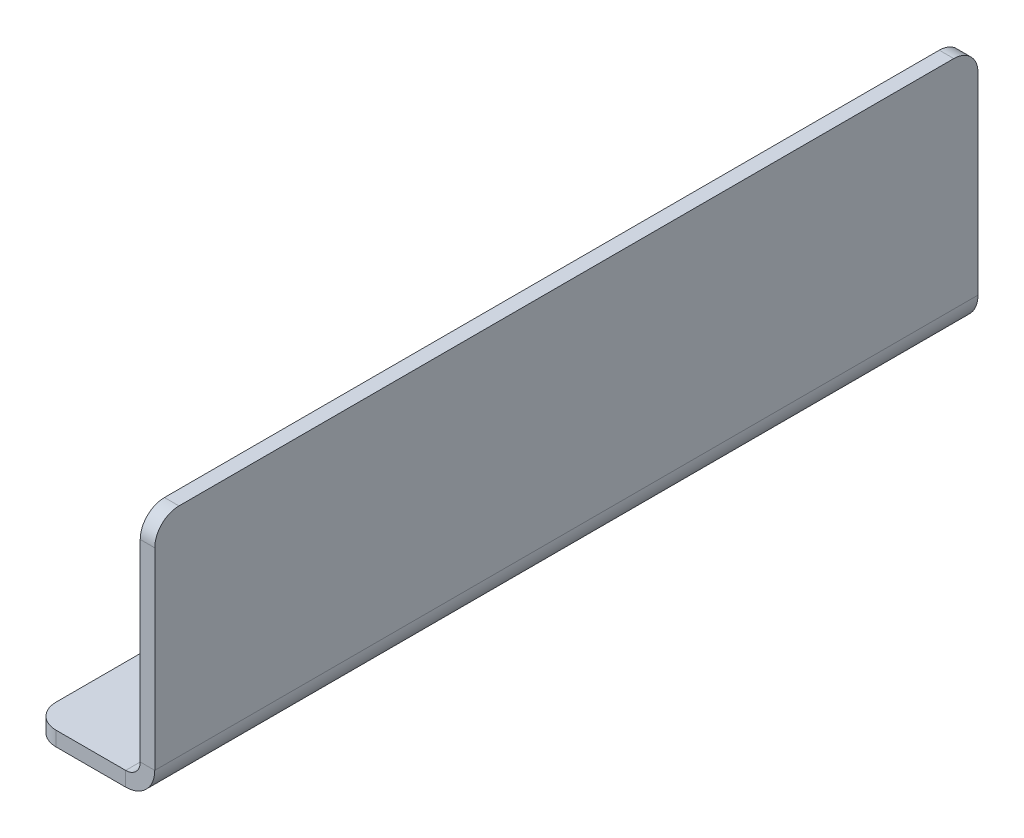
ISO-10303-21;
HEADER;
FILE_DESCRIPTION(('STEP AP214'),'2;1');
FILE_NAME('part.step','',(''),(''),'','','');
FILE_SCHEMA(('AUTOMOTIVE_DESIGN { 1 0 10303 214 1 1 1 1 }'));
ENDSEC;
DATA;
#1=APPLICATION_CONTEXT('core data for automotive mechanical design processes');
#2=APPLICATION_PROTOCOL_DEFINITION('international standard','automotive_design',2000,#1);
#3=PRODUCT_CONTEXT('',#1,'mechanical');
#4=PRODUCT('Part','Part','',(#3));
#5=PRODUCT_RELATED_PRODUCT_CATEGORY('part','',(#4));
#6=PRODUCT_DEFINITION_FORMATION('','',#4);
#7=PRODUCT_DEFINITION_CONTEXT('part definition',#1,'design');
#8=PRODUCT_DEFINITION('design','',#6,#7);
#9=PRODUCT_DEFINITION_SHAPE('','',#8);
#10=(LENGTH_UNIT() NAMED_UNIT(*) SI_UNIT(.MILLI.,.METRE.));
#11=(NAMED_UNIT(*) PLANE_ANGLE_UNIT() SI_UNIT($,.RADIAN.));
#12=(NAMED_UNIT(*) SI_UNIT($,.STERADIAN.) SOLID_ANGLE_UNIT());
#13=UNCERTAINTY_MEASURE_WITH_UNIT(LENGTH_MEASURE(1.E-05),#10,'distance_accuracy_value','');
#14=(GEOMETRIC_REPRESENTATION_CONTEXT(3) GLOBAL_UNCERTAINTY_ASSIGNED_CONTEXT((#13)) GLOBAL_UNIT_ASSIGNED_CONTEXT((#10,
#11,#12)) REPRESENTATION_CONTEXT('',''));
#15=CARTESIAN_POINT('',(0.,0.,0.));
#16=DIRECTION('',(0.,0.,1.));
#17=DIRECTION('',(1.,0.,0.));
#18=AXIS2_PLACEMENT_3D('',#15,#16,#17);
#19=CARTESIAN_POINT('',(0.,0.,170.));
#20=DIRECTION('',(0.,-1.,0.));
#21=DIRECTION('',(1.,0.,0.));
#22=AXIS2_PLACEMENT_3D('',#19,#20,#21);
#23=PLANE('',#22);
#24=CARTESIAN_POINT('',(-15.7,0.,25.));
#25=DIRECTION('',(0.,1.,0.));
#26=DIRECTION('',(0.,0.,1.));
#27=AXIS2_PLACEMENT_3D('',#24,#25,#26);
#28=CIRCLE('',#27,1.63195);
#29=CARTESIAN_POINT('',(-15.7,0.,26.63195));
#30=VERTEX_POINT('',#29);
#31=EDGE_CURVE('E288',#30,#30,#28,.T.);
#32=ORIENTED_EDGE('',*,*,#31,.T.);
#33=EDGE_LOOP('',(#32));
#34=FACE_BOUND('',#33,.T.);
#35=CARTESIAN_POINT('',(-15.7,0.,75.));
#36=DIRECTION('',(0.,1.,0.));
#37=DIRECTION('',(0.,0.,1.));
#38=AXIS2_PLACEMENT_3D('',#35,#36,#37);
#39=CIRCLE('',#38,1.63195);
#40=CARTESIAN_POINT('',(-15.7,0.,76.63195));
#41=VERTEX_POINT('',#40);
#42=EDGE_CURVE('E282',#41,#41,#39,.T.);
#43=ORIENTED_EDGE('',*,*,#42,.T.);
#44=EDGE_LOOP('',(#43));
#45=FACE_BOUND('',#44,.T.);
#46=DIRECTION('',(0.,0.,-1.));
#47=VECTOR('',#46,1.);
#48=CARTESIAN_POINT('',(-25.4,0.,170.));
#49=LINE('',#48,#47);
#50=CARTESIAN_POINT('',(-25.4,0.,165.));
#51=VERTEX_POINT('',#50);
#52=CARTESIAN_POINT('',(-25.4,0.,5.));
#53=VERTEX_POINT('',#52);
#54=EDGE_CURVE('E164',#51,#53,#49,.T.);
#55=ORIENTED_EDGE('',*,*,#54,.T.);
#56=CARTESIAN_POINT('',(-20.4,0.,5.));
#57=DIRECTION('',(0.,-1.,0.));
#58=DIRECTION('',(1.,0.,0.));
#59=AXIS2_PLACEMENT_3D('',#56,#57,#58);
#60=CIRCLE('',#59,5.);
#61=CARTESIAN_POINT('',(-20.4,0.,0.));
#62=VERTEX_POINT('',#61);
#63=EDGE_CURVE('E231',#53,#62,#60,.T.);
#64=ORIENTED_EDGE('',*,*,#63,.T.);
#65=DIRECTION('',(-1.,0.,0.));
#66=VECTOR('',#65,1.);
#67=CARTESIAN_POINT('',(0.,0.,0.));
#68=LINE('',#67,#66);
#69=CARTESIAN_POINT('',(-6.,0.,0.));
#70=VERTEX_POINT('',#69);
#71=EDGE_CURVE('E160',#70,#62,#68,.T.);
#72=ORIENTED_EDGE('',*,*,#71,.F.);
#73=DIRECTION('',(0.,0.,-1.));
#74=VECTOR('',#73,1.);
#75=CARTESIAN_POINT('',(-6.,0.,170.));
#76=LINE('',#75,#74);
#77=CARTESIAN_POINT('',(-6.,0.,170.));
#78=VERTEX_POINT('',#77);
#79=EDGE_CURVE('E154',#78,#70,#76,.T.);
#80=ORIENTED_EDGE('',*,*,#79,.F.);
#81=DIRECTION('',(-1.,0.,0.));
#82=VECTOR('',#81,1.);
#83=CARTESIAN_POINT('',(0.,0.,170.));
#84=LINE('',#83,#82);
#85=CARTESIAN_POINT('',(-20.4,0.,170.));
#86=VERTEX_POINT('',#85);
#87=EDGE_CURVE('E157',#78,#86,#84,.T.);
#88=ORIENTED_EDGE('',*,*,#87,.T.);
#89=CARTESIAN_POINT('',(-20.4,0.,165.));
#90=DIRECTION('',(0.,-1.,0.));
#91=DIRECTION('',(1.,0.,0.));
#92=AXIS2_PLACEMENT_3D('',#89,#90,#91);
#93=CIRCLE('',#92,5.);
#94=EDGE_CURVE('E229',#86,#51,#93,.T.);
#95=ORIENTED_EDGE('',*,*,#94,.T.);
#96=EDGE_LOOP('',(#55,#64,#72,#80,#88,#95));
#97=FACE_BOUND('',#96,.T.);
#98=CARTESIAN_POINT('',(-15.7,0.,125.));
#99=DIRECTION('',(0.,1.,0.));
#100=DIRECTION('',(0.,0.,1.));
#101=AXIS2_PLACEMENT_3D('',#98,#99,#100);
#102=CIRCLE('',#101,1.63195);
#103=CARTESIAN_POINT('',(-15.7,0.,126.63195));
#104=VERTEX_POINT('',#103);
#105=EDGE_CURVE('E186',#104,#104,#102,.T.);
#106=ORIENTED_EDGE('',*,*,#105,.T.);
#107=EDGE_LOOP('',(#106));
#108=FACE_BOUND('',#107,.T.);
#109=ADVANCED_FACE('F45',(#34,#45,#97,#108),#23,.T.);
#110=CARTESIAN_POINT('',(-6.,0.,170.));
#111=DIRECTION('',(0.,0.,1.));
#112=DIRECTION('',(1.,0.,0.));
#113=AXIS2_PLACEMENT_3D('',#110,#111,#112);
#114=PLANE('',#113);
#115=DIRECTION('',(0.,1.,0.));
#116=VECTOR('',#115,1.);
#117=CARTESIAN_POINT('',(-6.,0.,170.));
#118=LINE('',#117,#116);
#119=CARTESIAN_POINT('',(-6.,3.,170.));
#120=VERTEX_POINT('',#119);
#121=EDGE_CURVE('E135',#78,#120,#118,.T.);
#122=ORIENTED_EDGE('',*,*,#121,.F.);
#123=CARTESIAN_POINT('',(-6.,6.,170.));
#124=DIRECTION('',(0.,0.,1.));
#125=DIRECTION('',(1.,0.,0.));
#126=AXIS2_PLACEMENT_3D('',#123,#124,#125);
#127=CIRCLE('',#126,6.);
#128=CARTESIAN_POINT('',(0.,6.,170.));
#129=VERTEX_POINT('',#128);
#130=EDGE_CURVE('E140',#129,#78,#127,.F.);
#131=ORIENTED_EDGE('',*,*,#130,.F.);
#132=DIRECTION('',(1.,0.,0.));
#133=VECTOR('',#132,1.);
#134=CARTESIAN_POINT('',(-3.,6.,170.));
#135=LINE('',#134,#133);
#136=CARTESIAN_POINT('',(-3.,6.,170.));
#137=VERTEX_POINT('',#136);
#138=EDGE_CURVE('E148',#137,#129,#135,.T.);
#139=ORIENTED_EDGE('',*,*,#138,.F.);
#140=CARTESIAN_POINT('',(-6.,6.,170.));
#141=DIRECTION('',(0.,0.,1.));
#142=DIRECTION('',(1.,0.,0.));
#143=AXIS2_PLACEMENT_3D('',#140,#141,#142);
#144=CIRCLE('',#143,3.);
#145=EDGE_CURVE('E142',#137,#120,#144,.F.);
#146=ORIENTED_EDGE('',*,*,#145,.T.);
#147=EDGE_LOOP('',(#122,#131,#139,#146));
#148=FACE_BOUND('',#147,.T.);
#149=ADVANCED_FACE('F137',(#148),#114,.T.);
#150=CARTESIAN_POINT('',(-3.,6.,170.));
#151=DIRECTION('',(0.,0.,1.));
#152=DIRECTION('',(1.,0.,0.));
#153=AXIS2_PLACEMENT_3D('',#150,#151,#152);
#154=PLANE('',#153);
#155=DIRECTION('',(-1.,0.,0.));
#156=VECTOR('',#155,1.);
#157=CARTESIAN_POINT('',(0.,3.,170.));
#158=LINE('',#157,#156);
#159=CARTESIAN_POINT('',(-20.4,3.,170.));
#160=VERTEX_POINT('',#159);
#161=EDGE_CURVE('E169',#120,#160,#158,.T.);
#162=ORIENTED_EDGE('',*,*,#161,.T.);
#163=DIRECTION('',(0.,1.,0.));
#164=VECTOR('',#163,1.);
#165=CARTESIAN_POINT('',(-20.4,6.,170.));
#166=LINE('',#165,#164);
#167=EDGE_CURVE('E11',#160,#86,#166,.F.);
#168=ORIENTED_EDGE('',*,*,#167,.T.);
#169=ORIENTED_EDGE('',*,*,#87,.F.);
#170=ORIENTED_EDGE('',*,*,#121,.T.);
#171=EDGE_LOOP('',(#162,#168,#169,#170));
#172=FACE_BOUND('',#171,.T.);
#173=ADVANCED_FACE('F167',(#172),#154,.T.);
#174=CARTESIAN_POINT('',(0.,6.,0.));
#175=DIRECTION('',(0.,0.,-1.));
#176=DIRECTION('',(-1.,0.,0.));
#177=AXIS2_PLACEMENT_3D('',#174,#175,#176);
#178=PLANE('',#177);
#179=DIRECTION('',(-1.,0.,0.));
#180=VECTOR('',#179,1.);
#181=CARTESIAN_POINT('',(0.,6.,0.));
#182=LINE('',#181,#180);
#183=CARTESIAN_POINT('',(0.,6.,0.));
#184=VERTEX_POINT('',#183);
#185=CARTESIAN_POINT('',(-3.,6.,0.));
#186=VERTEX_POINT('',#185);
#187=EDGE_CURVE('E213',#184,#186,#182,.T.);
#188=ORIENTED_EDGE('',*,*,#187,.F.);
#189=CARTESIAN_POINT('',(-6.,6.,0.));
#190=DIRECTION('',(0.,0.,1.));
#191=DIRECTION('',(1.,0.,0.));
#192=AXIS2_PLACEMENT_3D('',#189,#190,#191);
#193=CIRCLE('',#192,6.);
#194=EDGE_CURVE('E188',#184,#70,#193,.F.);
#195=ORIENTED_EDGE('',*,*,#194,.T.);
#196=DIRECTION('',(0.,-1.,0.));
#197=VECTOR('',#196,1.);
#198=CARTESIAN_POINT('',(-6.,3.,0.));
#199=LINE('',#198,#197);
#200=CARTESIAN_POINT('',(-6.,3.,0.));
#201=VERTEX_POINT('',#200);
#202=EDGE_CURVE('E211',#201,#70,#199,.T.);
#203=ORIENTED_EDGE('',*,*,#202,.F.);
#204=CARTESIAN_POINT('',(-6.,6.,0.));
#205=DIRECTION('',(0.,0.,1.));
#206=DIRECTION('',(1.,0.,0.));
#207=AXIS2_PLACEMENT_3D('',#204,#205,#206);
#208=CIRCLE('',#207,3.);
#209=EDGE_CURVE('E194',#186,#201,#208,.F.);
#210=ORIENTED_EDGE('',*,*,#209,.F.);
#211=EDGE_LOOP('',(#188,#195,#203,#210));
#212=FACE_BOUND('',#211,.T.);
#213=ADVANCED_FACE('F340',(#212),#178,.T.);
#214=CARTESIAN_POINT('',(-6.,3.,0.));
#215=DIRECTION('',(0.,0.,-1.));
#216=DIRECTION('',(-1.,0.,0.));
#217=AXIS2_PLACEMENT_3D('',#214,#215,#216);
#218=PLANE('',#217);
#219=DIRECTION('',(0.,1.,0.));
#220=VECTOR('',#219,1.);
#221=CARTESIAN_POINT('',(-3.,0.,0.));
#222=LINE('',#221,#220);
#223=CARTESIAN_POINT('',(-3.,45.8,0.));
#224=VERTEX_POINT('',#223);
#225=EDGE_CURVE('E192',#224,#186,#222,.F.);
#226=ORIENTED_EDGE('',*,*,#225,.F.);
#227=DIRECTION('',(1.,0.,0.));
#228=VECTOR('',#227,1.);
#229=CARTESIAN_POINT('',(-6.,45.8,0.));
#230=LINE('',#229,#228);
#231=CARTESIAN_POINT('',(0.,45.8,0.));
#232=VERTEX_POINT('',#231);
#233=EDGE_CURVE('E233',#224,#232,#230,.T.);
#234=ORIENTED_EDGE('',*,*,#233,.T.);
#235=DIRECTION('',(0.,-1.,0.));
#236=VECTOR('',#235,1.);
#237=CARTESIAN_POINT('',(0.,0.,0.));
#238=LINE('',#237,#236);
#239=EDGE_CURVE('E190',#232,#184,#238,.T.);
#240=ORIENTED_EDGE('',*,*,#239,.T.);
#241=ORIENTED_EDGE('',*,*,#187,.T.);
#242=EDGE_LOOP('',(#226,#234,#240,#241));
#243=FACE_BOUND('',#242,.T.);
#244=ADVANCED_FACE('F255',(#243),#218,.T.);
#245=CARTESIAN_POINT('',(0.,3.,170.));
#246=DIRECTION('',(0.,-1.,0.));
#247=DIRECTION('',(1.,0.,0.));
#248=AXIS2_PLACEMENT_3D('',#245,#246,#247);
#249=PLANE('',#248);
#250=CARTESIAN_POINT('',(-15.7,3.,25.));
#251=DIRECTION('',(0.,1.,0.));
#252=DIRECTION('',(0.,0.,1.));
#253=AXIS2_PLACEMENT_3D('',#250,#251,#252);
#254=CIRCLE('',#253,1.63194999999999);
#255=CARTESIAN_POINT('',(-15.7,3.,26.63195));
#256=VERTEX_POINT('',#255);
#257=EDGE_CURVE('E291',#256,#256,#254,.T.);
#258=ORIENTED_EDGE('',*,*,#257,.F.);
#259=EDGE_LOOP('',(#258));
#260=FACE_BOUND('',#259,.T.);
#261=CARTESIAN_POINT('',(-15.7,3.,75.));
#262=DIRECTION('',(0.,1.,0.));
#263=DIRECTION('',(0.,0.,1.));
#264=AXIS2_PLACEMENT_3D('',#261,#262,#263);
#265=CIRCLE('',#264,1.63194999999999);
#266=CARTESIAN_POINT('',(-15.7,3.,76.63195));
#267=VERTEX_POINT('',#266);
#268=EDGE_CURVE('E285',#267,#267,#265,.T.);
#269=ORIENTED_EDGE('',*,*,#268,.F.);
#270=EDGE_LOOP('',(#269));
#271=FACE_BOUND('',#270,.T.);
#272=CARTESIAN_POINT('',(-15.7,3.,125.));
#273=DIRECTION('',(0.,1.,0.));
#274=DIRECTION('',(0.,0.,1.));
#275=AXIS2_PLACEMENT_3D('',#272,#273,#274);
#276=CIRCLE('',#275,1.63194999999999);
#277=CARTESIAN_POINT('',(-15.7,3.,126.63195));
#278=VERTEX_POINT('',#277);
#279=EDGE_CURVE('E279',#278,#278,#276,.T.);
#280=ORIENTED_EDGE('',*,*,#279,.F.);
#281=EDGE_LOOP('',(#280));
#282=FACE_BOUND('',#281,.T.);
#283=DIRECTION('',(-1.,0.,0.));
#284=VECTOR('',#283,1.);
#285=CARTESIAN_POINT('',(0.,3.,0.));
#286=LINE('',#285,#284);
#287=CARTESIAN_POINT('',(-20.4,3.,0.));
#288=VERTEX_POINT('',#287);
#289=EDGE_CURVE('E183',#201,#288,#286,.T.);
#290=ORIENTED_EDGE('',*,*,#289,.T.);
#291=CARTESIAN_POINT('',(-20.4,3.,5.));
#292=DIRECTION('',(0.,-1.,0.));
#293=DIRECTION('',(1.,0.,0.));
#294=AXIS2_PLACEMENT_3D('',#291,#292,#293);
#295=CIRCLE('',#294,5.);
#296=CARTESIAN_POINT('',(-25.4,3.,5.));
#297=VERTEX_POINT('',#296);
#298=EDGE_CURVE('E222',#288,#297,#295,.F.);
#299=ORIENTED_EDGE('',*,*,#298,.T.);
#300=DIRECTION('',(0.,0.,-1.));
#301=VECTOR('',#300,1.);
#302=CARTESIAN_POINT('',(-25.4,3.,170.));
#303=LINE('',#302,#301);
#304=CARTESIAN_POINT('',(-25.4,3.,165.));
#305=VERTEX_POINT('',#304);
#306=EDGE_CURVE('E208',#305,#297,#303,.T.);
#307=ORIENTED_EDGE('',*,*,#306,.F.);
#308=CARTESIAN_POINT('',(-20.4,3.,165.));
#309=DIRECTION('',(0.,-1.,0.));
#310=DIRECTION('',(1.,0.,0.));
#311=AXIS2_PLACEMENT_3D('',#308,#309,#310);
#312=CIRCLE('',#311,5.);
#313=EDGE_CURVE('E220',#305,#160,#312,.F.);
#314=ORIENTED_EDGE('',*,*,#313,.T.);
#315=ORIENTED_EDGE('',*,*,#161,.F.);
#316=DIRECTION('',(0.,0.,-1.));
#317=VECTOR('',#316,1.);
#318=CARTESIAN_POINT('',(-6.,3.,170.));
#319=LINE('',#318,#317);
#320=EDGE_CURVE('E182',#120,#201,#319,.T.);
#321=ORIENTED_EDGE('',*,*,#320,.T.);
#322=EDGE_LOOP('',(#290,#299,#307,#314,#315,#321));
#323=FACE_BOUND('',#322,.T.);
#324=ADVANCED_FACE('F274',(#260,#271,#282,#323),#249,.F.);
#325=CARTESIAN_POINT('',(-25.4,0.,170.));
#326=DIRECTION('',(-1.,0.,0.));
#327=DIRECTION('',(0.,0.,1.));
#328=AXIS2_PLACEMENT_3D('',#325,#326,#327);
#329=PLANE('',#328);
#330=ORIENTED_EDGE('',*,*,#306,.T.);
#331=DIRECTION('',(0.,1.,0.));
#332=VECTOR('',#331,1.);
#333=CARTESIAN_POINT('',(-25.4,0.,5.));
#334=LINE('',#333,#332);
#335=EDGE_CURVE('E227',#297,#53,#334,.F.);
#336=ORIENTED_EDGE('',*,*,#335,.T.);
#337=ORIENTED_EDGE('',*,*,#54,.F.);
#338=DIRECTION('',(0.,1.,0.));
#339=VECTOR('',#338,1.);
#340=CARTESIAN_POINT('',(-25.4,0.,165.));
#341=LINE('',#340,#339);
#342=EDGE_CURVE('E224',#51,#305,#341,.T.);
#343=ORIENTED_EDGE('',*,*,#342,.T.);
#344=EDGE_LOOP('',(#330,#336,#337,#343));
#345=FACE_BOUND('',#344,.T.);
#346=ADVANCED_FACE('F299',(#345),#329,.T.);
#347=CARTESIAN_POINT('',(-6.,6.,170.));
#348=DIRECTION('',(0.,0.,-1.));
#349=DIRECTION('',(-1.,0.,0.));
#350=AXIS2_PLACEMENT_3D('',#347,#348,#349);
#351=CYLINDRICAL_SURFACE('',#350,6.);
#352=ORIENTED_EDGE('',*,*,#194,.F.);
#353=DIRECTION('',(0.,0.,-1.));
#354=VECTOR('',#353,1.);
#355=CARTESIAN_POINT('',(0.,6.,170.));
#356=LINE('',#355,#354);
#357=EDGE_CURVE('E165',#129,#184,#356,.T.);
#358=ORIENTED_EDGE('',*,*,#357,.F.);
#359=ORIENTED_EDGE('',*,*,#130,.T.);
#360=ORIENTED_EDGE('',*,*,#79,.T.);
#361=EDGE_LOOP('',(#352,#358,#359,#360));
#362=FACE_BOUND('',#361,.T.);
#363=ADVANCED_FACE('F172',(#362),#351,.T.);
#364=CARTESIAN_POINT('',(0.,0.,170.));
#365=DIRECTION('',(1.,0.,0.));
#366=DIRECTION('',(0.,0.,-1.));
#367=AXIS2_PLACEMENT_3D('',#364,#365,#366);
#368=PLANE('',#367);
#369=ORIENTED_EDGE('',*,*,#239,.F.);
#370=CARTESIAN_POINT('',(0.,45.8,5.));
#371=DIRECTION('',(1.,0.,0.));
#372=DIRECTION('',(0.,0.,-1.));
#373=AXIS2_PLACEMENT_3D('',#370,#371,#372);
#374=CIRCLE('',#373,5.);
#375=CARTESIAN_POINT('',(0.,50.8,5.));
#376=VERTEX_POINT('',#375);
#377=EDGE_CURVE('E238',#232,#376,#374,.T.);
#378=ORIENTED_EDGE('',*,*,#377,.T.);
#379=DIRECTION('',(0.,0.,-1.));
#380=VECTOR('',#379,1.);
#381=CARTESIAN_POINT('',(0.,50.8,170.));
#382=LINE('',#381,#380);
#383=CARTESIAN_POINT('',(0.,50.8,165.));
#384=VERTEX_POINT('',#383);
#385=EDGE_CURVE('E204',#384,#376,#382,.T.);
#386=ORIENTED_EDGE('',*,*,#385,.F.);
#387=CARTESIAN_POINT('',(0.,45.8,165.));
#388=DIRECTION('',(1.,0.,0.));
#389=DIRECTION('',(0.,0.,-1.));
#390=AXIS2_PLACEMENT_3D('',#387,#388,#389);
#391=CIRCLE('',#390,5.);
#392=CARTESIAN_POINT('',(0.,45.8,170.));
#393=VERTEX_POINT('',#392);
#394=EDGE_CURVE('E236',#384,#393,#391,.T.);
#395=ORIENTED_EDGE('',*,*,#394,.T.);
#396=DIRECTION('',(0.,-1.,0.));
#397=VECTOR('',#396,1.);
#398=CARTESIAN_POINT('',(0.,0.,170.));
#399=LINE('',#398,#397);
#400=EDGE_CURVE('E174',#393,#129,#399,.T.);
#401=ORIENTED_EDGE('',*,*,#400,.T.);
#402=ORIENTED_EDGE('',*,*,#357,.T.);
#403=EDGE_LOOP('',(#369,#378,#386,#395,#401,#402));
#404=FACE_BOUND('',#403,.T.);
#405=ADVANCED_FACE('F261',(#404),#368,.T.);
#406=CARTESIAN_POINT('',(-3.,50.8,170.));
#407=DIRECTION('',(0.,1.,0.));
#408=DIRECTION('',(0.,0.,1.));
#409=AXIS2_PLACEMENT_3D('',#406,#407,#408);
#410=PLANE('',#409);
#411=ORIENTED_EDGE('',*,*,#385,.T.);
#412=DIRECTION('',(1.,0.,0.));
#413=VECTOR('',#412,1.);
#414=CARTESIAN_POINT('',(-3.,50.8,5.));
#415=LINE('',#414,#413);
#416=CARTESIAN_POINT('',(-3.,50.8,5.));
#417=VERTEX_POINT('',#416);
#418=EDGE_CURVE('E67',#376,#417,#415,.F.);
#419=ORIENTED_EDGE('',*,*,#418,.T.);
#420=DIRECTION('',(0.,0.,-1.));
#421=VECTOR('',#420,1.);
#422=CARTESIAN_POINT('',(-3.,50.8,170.));
#423=LINE('',#422,#421);
#424=CARTESIAN_POINT('',(-3.,50.8,165.));
#425=VERTEX_POINT('',#424);
#426=EDGE_CURVE('E202',#425,#417,#423,.T.);
#427=ORIENTED_EDGE('',*,*,#426,.F.);
#428=DIRECTION('',(1.,0.,0.));
#429=VECTOR('',#428,1.);
#430=CARTESIAN_POINT('',(-3.,50.8,165.));
#431=LINE('',#430,#429);
#432=EDGE_CURVE('E240',#425,#384,#431,.T.);
#433=ORIENTED_EDGE('',*,*,#432,.T.);
#434=EDGE_LOOP('',(#411,#419,#427,#433));
#435=FACE_BOUND('',#434,.T.);
#436=ADVANCED_FACE('F262',(#435),#410,.T.);
#437=CARTESIAN_POINT('',(-3.,0.,170.));
#438=DIRECTION('',(1.,0.,0.));
#439=DIRECTION('',(0.,0.,-1.));
#440=AXIS2_PLACEMENT_3D('',#437,#438,#439);
#441=PLANE('',#440);
#442=ORIENTED_EDGE('',*,*,#426,.T.);
#443=CARTESIAN_POINT('',(-3.,45.8,5.));
#444=DIRECTION('',(1.,0.,0.));
#445=DIRECTION('',(0.,0.,-1.));
#446=AXIS2_PLACEMENT_3D('',#443,#444,#445);
#447=CIRCLE('',#446,5.);
#448=EDGE_CURVE('E246',#417,#224,#447,.F.);
#449=ORIENTED_EDGE('',*,*,#448,.T.);
#450=ORIENTED_EDGE('',*,*,#225,.T.);
#451=DIRECTION('',(0.,0.,-1.));
#452=VECTOR('',#451,1.);
#453=CARTESIAN_POINT('',(-3.,6.,170.));
#454=LINE('',#453,#452);
#455=EDGE_CURVE('E199',#137,#186,#454,.T.);
#456=ORIENTED_EDGE('',*,*,#455,.F.);
#457=DIRECTION('',(0.,1.,0.));
#458=VECTOR('',#457,1.);
#459=CARTESIAN_POINT('',(-3.,0.,170.));
#460=LINE('',#459,#458);
#461=CARTESIAN_POINT('',(-3.,45.8,170.));
#462=VERTEX_POINT('',#461);
#463=EDGE_CURVE('E176',#462,#137,#460,.F.);
#464=ORIENTED_EDGE('',*,*,#463,.F.);
#465=CARTESIAN_POINT('',(-3.,45.8,165.));
#466=DIRECTION('',(1.,0.,0.));
#467=DIRECTION('',(0.,0.,-1.));
#468=AXIS2_PLACEMENT_3D('',#465,#466,#467);
#469=CIRCLE('',#468,5.);
#470=EDGE_CURVE('E244',#462,#425,#469,.F.);
#471=ORIENTED_EDGE('',*,*,#470,.T.);
#472=EDGE_LOOP('',(#442,#449,#450,#456,#464,#471));
#473=FACE_BOUND('',#472,.T.);
#474=ADVANCED_FACE('F250',(#473),#441,.F.);
#475=CARTESIAN_POINT('',(-6.,6.,170.));
#476=DIRECTION('',(0.,0.,-1.));
#477=DIRECTION('',(-1.,0.,0.));
#478=AXIS2_PLACEMENT_3D('',#475,#476,#477);
#479=CYLINDRICAL_SURFACE('',#478,3.);
#480=ORIENTED_EDGE('',*,*,#209,.T.);
#481=ORIENTED_EDGE('',*,*,#320,.F.);
#482=ORIENTED_EDGE('',*,*,#145,.F.);
#483=ORIENTED_EDGE('',*,*,#455,.T.);
#484=EDGE_LOOP('',(#480,#481,#482,#483));
#485=FACE_BOUND('',#484,.T.);
#486=ADVANCED_FACE('F270',(#485),#479,.F.);
#487=CARTESIAN_POINT('',(-6.,6.,170.));
#488=DIRECTION('',(0.,0.,1.));
#489=DIRECTION('',(1.,0.,0.));
#490=AXIS2_PLACEMENT_3D('',#487,#488,#489);
#491=PLANE('',#490);
#492=ORIENTED_EDGE('',*,*,#400,.F.);
#493=DIRECTION('',(1.,0.,0.));
#494=VECTOR('',#493,1.);
#495=CARTESIAN_POINT('',(-6.,45.8,170.));
#496=LINE('',#495,#494);
#497=EDGE_CURVE('E53',#393,#462,#496,.F.);
#498=ORIENTED_EDGE('',*,*,#497,.T.);
#499=ORIENTED_EDGE('',*,*,#463,.T.);
#500=ORIENTED_EDGE('',*,*,#138,.T.);
#501=EDGE_LOOP('',(#492,#498,#499,#500));
#502=FACE_BOUND('',#501,.T.);
#503=ADVANCED_FACE('F267',(#502),#491,.T.);
#504=CARTESIAN_POINT('',(-6.,6.,0.));
#505=DIRECTION('',(0.,0.,1.));
#506=DIRECTION('',(1.,0.,0.));
#507=AXIS2_PLACEMENT_3D('',#504,#505,#506);
#508=PLANE('',#507);
#509=ORIENTED_EDGE('',*,*,#71,.T.);
#510=DIRECTION('',(0.,1.,0.));
#511=VECTOR('',#510,1.);
#512=CARTESIAN_POINT('',(-20.4,3.,0.));
#513=LINE('',#512,#511);
#514=EDGE_CURVE('E147',#62,#288,#513,.T.);
#515=ORIENTED_EDGE('',*,*,#514,.T.);
#516=ORIENTED_EDGE('',*,*,#289,.F.);
#517=ORIENTED_EDGE('',*,*,#202,.T.);
#518=EDGE_LOOP('',(#509,#515,#516,#517));
#519=FACE_BOUND('',#518,.T.);
#520=ADVANCED_FACE('F308',(#519),#508,.F.);
#521=CARTESIAN_POINT('',(-15.7,3.,125.));
#522=DIRECTION('',(0.,1.,0.));
#523=DIRECTION('',(0.,0.,1.));
#524=AXIS2_PLACEMENT_3D('',#521,#522,#523);
#525=CYLINDRICAL_SURFACE('',#524,1.63194999999999);
#526=ORIENTED_EDGE('',*,*,#105,.F.);
#527=EDGE_LOOP('',(#526));
#528=FACE_BOUND('',#527,.T.);
#529=ORIENTED_EDGE('',*,*,#279,.T.);
#530=EDGE_LOOP('',(#529));
#531=FACE_BOUND('',#530,.T.);
#532=ADVANCED_FACE('F305',(#528,#531),#525,.F.);
#533=CARTESIAN_POINT('',(-15.7,3.,75.));
#534=DIRECTION('',(0.,1.,0.));
#535=DIRECTION('',(0.,0.,1.));
#536=AXIS2_PLACEMENT_3D('',#533,#534,#535);
#537=CYLINDRICAL_SURFACE('',#536,1.63194999999999);
#538=ORIENTED_EDGE('',*,*,#42,.F.);
#539=EDGE_LOOP('',(#538));
#540=FACE_BOUND('',#539,.T.);
#541=ORIENTED_EDGE('',*,*,#268,.T.);
#542=EDGE_LOOP('',(#541));
#543=FACE_BOUND('',#542,.T.);
#544=ADVANCED_FACE('F307',(#540,#543),#537,.F.);
#545=CARTESIAN_POINT('',(-15.7,3.,25.));
#546=DIRECTION('',(0.,1.,0.));
#547=DIRECTION('',(0.,0.,1.));
#548=AXIS2_PLACEMENT_3D('',#545,#546,#547);
#549=CYLINDRICAL_SURFACE('',#548,1.63194999999999);
#550=ORIENTED_EDGE('',*,*,#31,.F.);
#551=EDGE_LOOP('',(#550));
#552=FACE_BOUND('',#551,.T.);
#553=ORIENTED_EDGE('',*,*,#257,.T.);
#554=EDGE_LOOP('',(#553));
#555=FACE_BOUND('',#554,.T.);
#556=ADVANCED_FACE('F295',(#552,#555),#549,.F.);
#557=CARTESIAN_POINT('',(-20.4,6.,5.));
#558=DIRECTION('',(0.,-1.,0.));
#559=DIRECTION('',(0.,0.,-1.));
#560=AXIS2_PLACEMENT_3D('',#557,#558,#559);
#561=CYLINDRICAL_SURFACE('',#560,5.);
#562=ORIENTED_EDGE('',*,*,#63,.F.);
#563=ORIENTED_EDGE('',*,*,#335,.F.);
#564=ORIENTED_EDGE('',*,*,#298,.F.);
#565=ORIENTED_EDGE('',*,*,#514,.F.);
#566=EDGE_LOOP('',(#562,#563,#564,#565));
#567=FACE_BOUND('',#566,.T.);
#568=ADVANCED_FACE('F345',(#567),#561,.T.);
#569=CARTESIAN_POINT('',(-6.,45.8,5.));
#570=DIRECTION('',(1.,0.,0.));
#571=DIRECTION('',(0.,0.,-1.));
#572=AXIS2_PLACEMENT_3D('',#569,#570,#571);
#573=CYLINDRICAL_SURFACE('',#572,5.);
#574=ORIENTED_EDGE('',*,*,#448,.F.);
#575=ORIENTED_EDGE('',*,*,#418,.F.);
#576=ORIENTED_EDGE('',*,*,#377,.F.);
#577=ORIENTED_EDGE('',*,*,#233,.F.);
#578=EDGE_LOOP('',(#574,#575,#576,#577));
#579=FACE_BOUND('',#578,.T.);
#580=ADVANCED_FACE('F258',(#579),#573,.T.);
#581=CARTESIAN_POINT('',(-3.,45.8,165.));
#582=DIRECTION('',(1.,0.,0.));
#583=DIRECTION('',(0.,0.,-1.));
#584=AXIS2_PLACEMENT_3D('',#581,#582,#583);
#585=CYLINDRICAL_SURFACE('',#584,5.);
#586=ORIENTED_EDGE('',*,*,#470,.F.);
#587=ORIENTED_EDGE('',*,*,#497,.F.);
#588=ORIENTED_EDGE('',*,*,#394,.F.);
#589=ORIENTED_EDGE('',*,*,#432,.F.);
#590=EDGE_LOOP('',(#586,#587,#588,#589));
#591=FACE_BOUND('',#590,.T.);
#592=ADVANCED_FACE('F266',(#591),#585,.T.);
#593=CARTESIAN_POINT('',(-20.4,0.,165.));
#594=DIRECTION('',(0.,1.,0.));
#595=DIRECTION('',(0.,0.,1.));
#596=AXIS2_PLACEMENT_3D('',#593,#594,#595);
#597=CYLINDRICAL_SURFACE('',#596,5.);
#598=ORIENTED_EDGE('',*,*,#94,.F.);
#599=ORIENTED_EDGE('',*,*,#167,.F.);
#600=ORIENTED_EDGE('',*,*,#313,.F.);
#601=ORIENTED_EDGE('',*,*,#342,.F.);
#602=EDGE_LOOP('',(#598,#599,#600,#601));
#603=FACE_BOUND('',#602,.T.);
#604=ADVANCED_FACE('F47',(#603),#597,.T.);
#605=CLOSED_SHELL('',(#109,#149,#173,#213,#244,#324,#346,#363,#405,#436,#474,#486,#503,#520,
#532,#544,#556,#568,#580,#592,#604));
#606=MANIFOLD_SOLID_BREP('B2',#605);
#607=ADVANCED_BREP_SHAPE_REPRESENTATION('',(#18,#606),#14);
#608=SHAPE_DEFINITION_REPRESENTATION(#9,#607);
ENDSEC;
END-ISO-10303-21;
